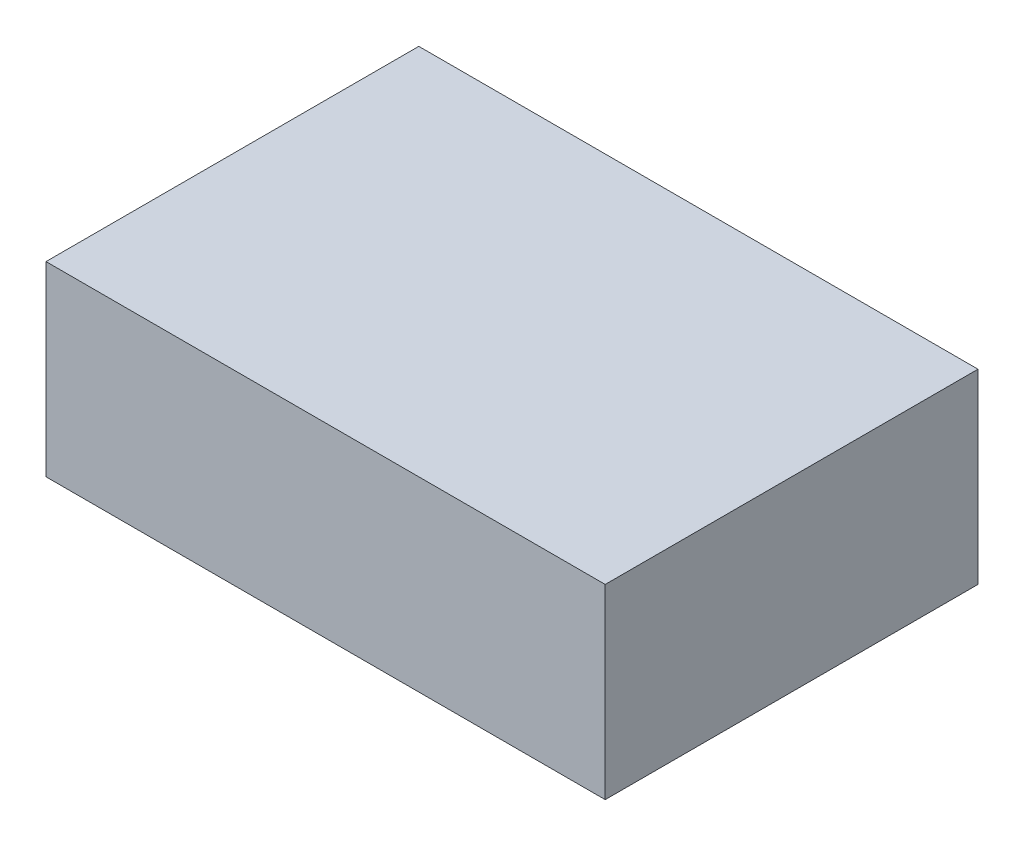
ISO-10303-21;
HEADER;
FILE_DESCRIPTION(('STEP AP214'),'2;1');
FILE_NAME('part.step','',(''),(''),'','','');
FILE_SCHEMA(('AUTOMOTIVE_DESIGN { 1 0 10303 214 1 1 1 1 }'));
ENDSEC;
DATA;
#1=APPLICATION_CONTEXT('core data for automotive mechanical design processes');
#2=APPLICATION_PROTOCOL_DEFINITION('international standard','automotive_design',2000,#1);
#3=PRODUCT_CONTEXT('',#1,'mechanical');
#4=PRODUCT('Part','Part','',(#3));
#5=PRODUCT_RELATED_PRODUCT_CATEGORY('part','',(#4));
#6=PRODUCT_DEFINITION_FORMATION('','',#4);
#7=PRODUCT_DEFINITION_CONTEXT('part definition',#1,'design');
#8=PRODUCT_DEFINITION('design','',#6,#7);
#9=PRODUCT_DEFINITION_SHAPE('','',#8);
#10=(LENGTH_UNIT() NAMED_UNIT(*) SI_UNIT(.MILLI.,.METRE.));
#11=(NAMED_UNIT(*) PLANE_ANGLE_UNIT() SI_UNIT($,.RADIAN.));
#12=(NAMED_UNIT(*) SI_UNIT($,.STERADIAN.) SOLID_ANGLE_UNIT());
#13=UNCERTAINTY_MEASURE_WITH_UNIT(LENGTH_MEASURE(1.E-05),#10,'distance_accuracy_value','');
#14=(GEOMETRIC_REPRESENTATION_CONTEXT(3) GLOBAL_UNCERTAINTY_ASSIGNED_CONTEXT((#13)) GLOBAL_UNIT_ASSIGNED_CONTEXT((#10,
#11,#12)) REPRESENTATION_CONTEXT('',''));
#15=CARTESIAN_POINT('',(0.,0.,0.));
#16=DIRECTION('',(0.,0.,1.));
#17=DIRECTION('',(1.,0.,0.));
#18=AXIS2_PLACEMENT_3D('',#15,#16,#17);
#19=CARTESIAN_POINT('',(0.6,0.4,-0.4));
#20=DIRECTION('',(-1.,0.,0.));
#21=DIRECTION('',(0.,0.,1.));
#22=AXIS2_PLACEMENT_3D('',#19,#20,#21);
#23=PLANE('',#22);
#24=DIRECTION('',(0.,0.,-1.));
#25=VECTOR('',#24,1.);
#26=CARTESIAN_POINT('',(0.6,0.,-0.4));
#27=LINE('',#26,#25);
#28=CARTESIAN_POINT('',(0.6,0.,0.4));
#29=VERTEX_POINT('',#28);
#30=CARTESIAN_POINT('',(0.6,0.,-0.4));
#31=VERTEX_POINT('',#30);
#32=EDGE_CURVE('E98',#29,#31,#27,.T.);
#33=ORIENTED_EDGE('',*,*,#32,.T.);
#34=DIRECTION('',(0.,-1.,0.));
#35=VECTOR('',#34,1.);
#36=CARTESIAN_POINT('',(0.6,0.4,-0.4));
#37=LINE('',#36,#35);
#38=CARTESIAN_POINT('',(0.6,0.4,-0.4));
#39=VERTEX_POINT('',#38);
#40=EDGE_CURVE('E11',#39,#31,#37,.T.);
#41=ORIENTED_EDGE('',*,*,#40,.F.);
#42=DIRECTION('',(0.,0.,-1.));
#43=VECTOR('',#42,1.);
#44=CARTESIAN_POINT('',(0.6,0.4,-0.4));
#45=LINE('',#44,#43);
#46=CARTESIAN_POINT('',(0.6,0.4,0.4));
#47=VERTEX_POINT('',#46);
#48=EDGE_CURVE('E86',#47,#39,#45,.T.);
#49=ORIENTED_EDGE('',*,*,#48,.F.);
#50=DIRECTION('',(0.,-1.,0.));
#51=VECTOR('',#50,1.);
#52=CARTESIAN_POINT('',(0.6,0.4,0.4));
#53=LINE('',#52,#51);
#54=EDGE_CURVE('E94',#47,#29,#53,.T.);
#55=ORIENTED_EDGE('',*,*,#54,.T.);
#56=EDGE_LOOP('',(#33,#41,#49,#55));
#57=FACE_BOUND('',#56,.T.);
#58=ADVANCED_FACE('F35',(#57),#23,.F.);
#59=CARTESIAN_POINT('',(-0.6,0.4,-0.4));
#60=DIRECTION('',(0.,0.,1.));
#61=DIRECTION('',(1.,0.,0.));
#62=AXIS2_PLACEMENT_3D('',#59,#60,#61);
#63=PLANE('',#62);
#64=DIRECTION('',(-1.,0.,0.));
#65=VECTOR('',#64,1.);
#66=CARTESIAN_POINT('',(-0.6,0.,-0.4));
#67=LINE('',#66,#65);
#68=CARTESIAN_POINT('',(-0.6,0.,-0.4));
#69=VERTEX_POINT('',#68);
#70=EDGE_CURVE('E90',#31,#69,#67,.T.);
#71=ORIENTED_EDGE('',*,*,#70,.T.);
#72=DIRECTION('',(0.,-1.,0.));
#73=VECTOR('',#72,1.);
#74=CARTESIAN_POINT('',(-0.6,0.4,-0.4));
#75=LINE('',#74,#73);
#76=CARTESIAN_POINT('',(-0.6,0.4,-0.4));
#77=VERTEX_POINT('',#76);
#78=EDGE_CURVE('E43',#77,#69,#75,.T.);
#79=ORIENTED_EDGE('',*,*,#78,.F.);
#80=DIRECTION('',(-1.,0.,0.));
#81=VECTOR('',#80,1.);
#82=CARTESIAN_POINT('',(-0.6,0.4,-0.4));
#83=LINE('',#82,#81);
#84=EDGE_CURVE('E81',#39,#77,#83,.T.);
#85=ORIENTED_EDGE('',*,*,#84,.F.);
#86=ORIENTED_EDGE('',*,*,#40,.T.);
#87=EDGE_LOOP('',(#71,#79,#85,#86));
#88=FACE_BOUND('',#87,.T.);
#89=ADVANCED_FACE('F89',(#88),#63,.F.);
#90=CARTESIAN_POINT('',(-0.6,0.4,-0.4));
#91=DIRECTION('',(1.,0.,0.));
#92=DIRECTION('',(0.,0.,-1.));
#93=AXIS2_PLACEMENT_3D('',#90,#91,#92);
#94=PLANE('',#93);
#95=DIRECTION('',(0.,0.,1.));
#96=VECTOR('',#95,1.);
#97=CARTESIAN_POINT('',(-0.6,0.,-0.4));
#98=LINE('',#97,#96);
#99=CARTESIAN_POINT('',(-0.6,0.,0.4));
#100=VERTEX_POINT('',#99);
#101=EDGE_CURVE('E68',#69,#100,#98,.T.);
#102=ORIENTED_EDGE('',*,*,#101,.T.);
#103=DIRECTION('',(0.,-1.,0.));
#104=VECTOR('',#103,1.);
#105=CARTESIAN_POINT('',(-0.6,0.4,0.4));
#106=LINE('',#105,#104);
#107=CARTESIAN_POINT('',(-0.6,0.4,0.4));
#108=VERTEX_POINT('',#107);
#109=EDGE_CURVE('E91',#108,#100,#106,.T.);
#110=ORIENTED_EDGE('',*,*,#109,.F.);
#111=DIRECTION('',(0.,0.,1.));
#112=VECTOR('',#111,1.);
#113=CARTESIAN_POINT('',(-0.6,0.4,-0.4));
#114=LINE('',#113,#112);
#115=EDGE_CURVE('E84',#77,#108,#114,.T.);
#116=ORIENTED_EDGE('',*,*,#115,.F.);
#117=ORIENTED_EDGE('',*,*,#78,.T.);
#118=EDGE_LOOP('',(#102,#110,#116,#117));
#119=FACE_BOUND('',#118,.T.);
#120=ADVANCED_FACE('F92',(#119),#94,.F.);
#121=CARTESIAN_POINT('',(-0.6,0.4,0.4));
#122=DIRECTION('',(0.,0.,-1.));
#123=DIRECTION('',(-1.,0.,0.));
#124=AXIS2_PLACEMENT_3D('',#121,#122,#123);
#125=PLANE('',#124);
#126=DIRECTION('',(1.,0.,0.));
#127=VECTOR('',#126,1.);
#128=CARTESIAN_POINT('',(-0.6,0.,0.4));
#129=LINE('',#128,#127);
#130=EDGE_CURVE('E74',#100,#29,#129,.T.);
#131=ORIENTED_EDGE('',*,*,#130,.T.);
#132=ORIENTED_EDGE('',*,*,#54,.F.);
#133=DIRECTION('',(1.,0.,0.));
#134=VECTOR('',#133,1.);
#135=CARTESIAN_POINT('',(-0.6,0.4,0.4));
#136=LINE('',#135,#134);
#137=EDGE_CURVE('E51',#108,#47,#136,.T.);
#138=ORIENTED_EDGE('',*,*,#137,.F.);
#139=ORIENTED_EDGE('',*,*,#109,.T.);
#140=EDGE_LOOP('',(#131,#132,#138,#139));
#141=FACE_BOUND('',#140,.T.);
#142=ADVANCED_FACE('F105',(#141),#125,.F.);
#143=CARTESIAN_POINT('',(0.,0.4,0.));
#144=DIRECTION('',(0.,1.,0.));
#145=DIRECTION('',(0.,0.,1.));
#146=AXIS2_PLACEMENT_3D('',#143,#144,#145);
#147=PLANE('',#146);
#148=ORIENTED_EDGE('',*,*,#48,.T.);
#149=ORIENTED_EDGE('',*,*,#84,.T.);
#150=ORIENTED_EDGE('',*,*,#115,.T.);
#151=ORIENTED_EDGE('',*,*,#137,.T.);
#152=EDGE_LOOP('',(#148,#149,#150,#151));
#153=FACE_BOUND('',#152,.T.);
#154=ADVANCED_FACE('F82',(#153),#147,.T.);
#155=CARTESIAN_POINT('',(0.,0.,0.));
#156=DIRECTION('',(0.,1.,0.));
#157=DIRECTION('',(0.,0.,1.));
#158=AXIS2_PLACEMENT_3D('',#155,#156,#157);
#159=PLANE('',#158);
#160=ORIENTED_EDGE('',*,*,#32,.F.);
#161=ORIENTED_EDGE('',*,*,#130,.F.);
#162=ORIENTED_EDGE('',*,*,#101,.F.);
#163=ORIENTED_EDGE('',*,*,#70,.F.);
#164=EDGE_LOOP('',(#160,#161,#162,#163));
#165=FACE_BOUND('',#164,.T.);
#166=ADVANCED_FACE('F108',(#165),#159,.F.);
#167=CLOSED_SHELL('',(#58,#89,#120,#142,#154,#166));
#168=MANIFOLD_SOLID_BREP('B2',#167);
#169=ADVANCED_BREP_SHAPE_REPRESENTATION('',(#18,#168),#14);
#170=SHAPE_DEFINITION_REPRESENTATION(#9,#169);
ENDSEC;
END-ISO-10303-21;
